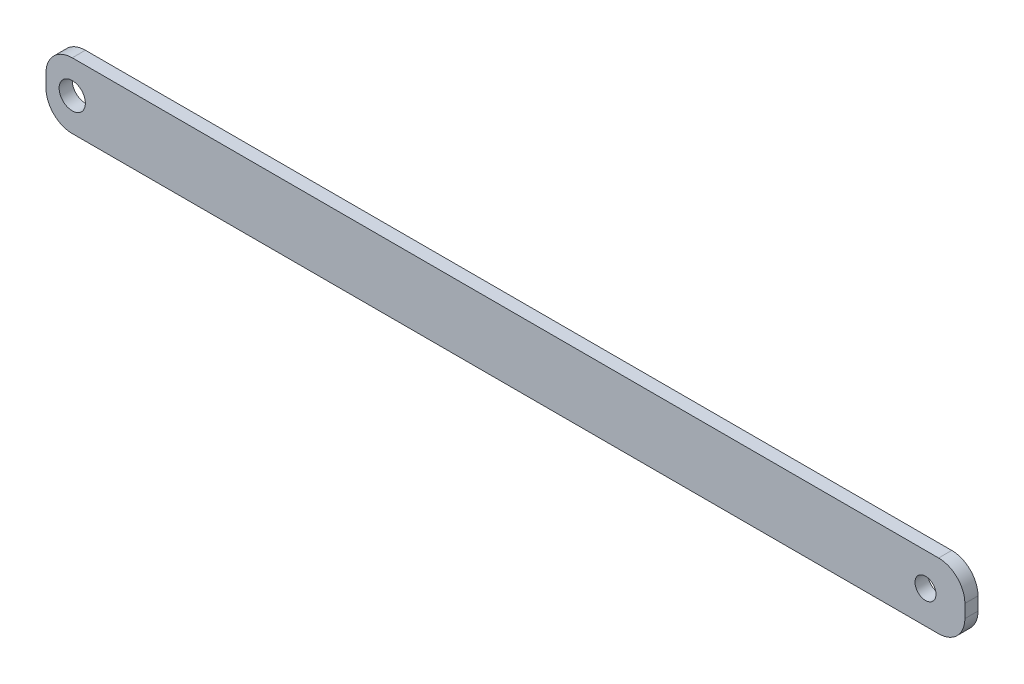
ISO-10303-21;
HEADER;
FILE_DESCRIPTION(('STEP AP214'),'2;1');
FILE_NAME('part.step','',(''),(''),'','','');
FILE_SCHEMA(('AUTOMOTIVE_DESIGN { 1 0 10303 214 1 1 1 1 }'));
ENDSEC;
DATA;
#1=APPLICATION_CONTEXT('core data for automotive mechanical design processes');
#2=APPLICATION_PROTOCOL_DEFINITION('international standard','automotive_design',2000,#1);
#3=PRODUCT_CONTEXT('',#1,'mechanical');
#4=PRODUCT('Part','Part','',(#3));
#5=PRODUCT_RELATED_PRODUCT_CATEGORY('part','',(#4));
#6=PRODUCT_DEFINITION_FORMATION('','',#4);
#7=PRODUCT_DEFINITION_CONTEXT('part definition',#1,'design');
#8=PRODUCT_DEFINITION('design','',#6,#7);
#9=PRODUCT_DEFINITION_SHAPE('','',#8);
#10=(LENGTH_UNIT() NAMED_UNIT(*) SI_UNIT(.MILLI.,.METRE.));
#11=(NAMED_UNIT(*) PLANE_ANGLE_UNIT() SI_UNIT($,.RADIAN.));
#12=(NAMED_UNIT(*) SI_UNIT($,.STERADIAN.) SOLID_ANGLE_UNIT());
#13=UNCERTAINTY_MEASURE_WITH_UNIT(LENGTH_MEASURE(1.E-05),#10,'distance_accuracy_value','');
#14=(GEOMETRIC_REPRESENTATION_CONTEXT(3) GLOBAL_UNCERTAINTY_ASSIGNED_CONTEXT((#13)) GLOBAL_UNIT_ASSIGNED_CONTEXT((#10,
#11,#12)) REPRESENTATION_CONTEXT('',''));
#15=CARTESIAN_POINT('',(0.,0.,0.));
#16=DIRECTION('',(0.,0.,1.));
#17=DIRECTION('',(1.,0.,0.));
#18=AXIS2_PLACEMENT_3D('',#15,#16,#17);
#19=CARTESIAN_POINT('',(15.,-12.5,2.5));
#20=DIRECTION('',(-1.,0.,0.));
#21=DIRECTION('',(0.,1.,0.));
#22=AXIS2_PLACEMENT_3D('',#19,#20,#21);
#23=PLANE('',#22);
#24=DIRECTION('',(0.,0.,1.));
#25=VECTOR('',#24,1.);
#26=CARTESIAN_POINT('',(15.,-2.5,2.5));
#27=LINE('',#26,#25);
#28=CARTESIAN_POINT('',(15.,-2.5,-2.5));
#29=VERTEX_POINT('',#28);
#30=CARTESIAN_POINT('',(15.,-2.5,2.5));
#31=VERTEX_POINT('',#30);
#32=EDGE_CURVE('E11',#29,#31,#27,.T.);
#33=ORIENTED_EDGE('',*,*,#32,.F.);
#34=DIRECTION('',(0.,1.,0.));
#35=VECTOR('',#34,1.);
#36=CARTESIAN_POINT('',(15.,-12.5,-2.5));
#37=LINE('',#36,#35);
#38=CARTESIAN_POINT('',(15.,2.5,-2.5));
#39=VERTEX_POINT('',#38);
#40=EDGE_CURVE('E103',#29,#39,#37,.T.);
#41=ORIENTED_EDGE('',*,*,#40,.T.);
#42=DIRECTION('',(0.,0.,1.));
#43=VECTOR('',#42,1.);
#44=CARTESIAN_POINT('',(15.,2.5,2.5));
#45=LINE('',#44,#43);
#46=CARTESIAN_POINT('',(15.,2.5,2.5));
#47=VERTEX_POINT('',#46);
#48=EDGE_CURVE('E46',#39,#47,#45,.T.);
#49=ORIENTED_EDGE('',*,*,#48,.T.);
#50=DIRECTION('',(0.,1.,0.));
#51=VECTOR('',#50,1.);
#52=CARTESIAN_POINT('',(15.,-12.5,2.5));
#53=LINE('',#52,#51);
#54=EDGE_CURVE('E145',#31,#47,#53,.T.);
#55=ORIENTED_EDGE('',*,*,#54,.F.);
#56=EDGE_LOOP('',(#33,#41,#49,#55));
#57=FACE_BOUND('',#56,.T.);
#58=ADVANCED_FACE('F36',(#57),#23,.F.);
#59=CARTESIAN_POINT('',(5.,2.5,2.5));
#60=DIRECTION('',(0.,0.,-1.));
#61=DIRECTION('',(-1.,0.,0.));
#62=AXIS2_PLACEMENT_3D('',#59,#60,#61);
#63=CYLINDRICAL_SURFACE('',#62,10.);
#64=ORIENTED_EDGE('',*,*,#48,.F.);
#65=CARTESIAN_POINT('',(5.,2.5,-2.5));
#66=DIRECTION('',(0.,0.,-1.));
#67=DIRECTION('',(-1.,0.,0.));
#68=AXIS2_PLACEMENT_3D('',#65,#66,#67);
#69=CIRCLE('',#68,10.);
#70=CARTESIAN_POINT('',(5.,12.5,-2.5));
#71=VERTEX_POINT('',#70);
#72=EDGE_CURVE('E125',#39,#71,#69,.F.);
#73=ORIENTED_EDGE('',*,*,#72,.T.);
#74=DIRECTION('',(0.,0.,1.));
#75=VECTOR('',#74,1.);
#76=CARTESIAN_POINT('',(5.,12.5,2.5));
#77=LINE('',#76,#75);
#78=CARTESIAN_POINT('',(5.,12.5,2.5));
#79=VERTEX_POINT('',#78);
#80=EDGE_CURVE('E138',#71,#79,#77,.T.);
#81=ORIENTED_EDGE('',*,*,#80,.T.);
#82=CARTESIAN_POINT('',(5.,2.5,2.5));
#83=DIRECTION('',(0.,0.,-1.));
#84=DIRECTION('',(-1.,0.,0.));
#85=AXIS2_PLACEMENT_3D('',#82,#83,#84);
#86=CIRCLE('',#85,10.);
#87=EDGE_CURVE('E154',#47,#79,#86,.F.);
#88=ORIENTED_EDGE('',*,*,#87,.F.);
#89=EDGE_LOOP('',(#64,#73,#81,#88));
#90=FACE_BOUND('',#89,.T.);
#91=ADVANCED_FACE('F157',(#90),#63,.T.);
#92=CARTESIAN_POINT('',(-335.,12.5,2.50000000000004));
#93=DIRECTION('',(0.,1.,0.));
#94=DIRECTION('',(1.,0.,0.));
#95=AXIS2_PLACEMENT_3D('',#92,#93,#94);
#96=PLANE('',#95);
#97=ORIENTED_EDGE('',*,*,#80,.F.);
#98=DIRECTION('',(-1.,0.,0.));
#99=VECTOR('',#98,1.);
#100=CARTESIAN_POINT('',(-335.,12.5,-2.49999999999996));
#101=LINE('',#100,#99);
#102=CARTESIAN_POINT('',(-325.,12.5,-2.49999999999996));
#103=VERTEX_POINT('',#102);
#104=EDGE_CURVE('E122',#103,#71,#101,.F.);
#105=ORIENTED_EDGE('',*,*,#104,.F.);
#106=DIRECTION('',(0.,0.,1.));
#107=VECTOR('',#106,1.);
#108=CARTESIAN_POINT('',(-325.,12.5,2.50000000000004));
#109=LINE('',#108,#107);
#110=CARTESIAN_POINT('',(-325.,12.5,2.50000000000004));
#111=VERTEX_POINT('',#110);
#112=EDGE_CURVE('E135',#103,#111,#109,.T.);
#113=ORIENTED_EDGE('',*,*,#112,.T.);
#114=DIRECTION('',(1.,0.,0.));
#115=VECTOR('',#114,1.);
#116=CARTESIAN_POINT('',(-335.,12.5,2.50000000000004));
#117=LINE('',#116,#115);
#118=EDGE_CURVE('E158',#111,#79,#117,.T.);
#119=ORIENTED_EDGE('',*,*,#118,.T.);
#120=EDGE_LOOP('',(#97,#105,#113,#119));
#121=FACE_BOUND('',#120,.T.);
#122=ADVANCED_FACE('F200',(#121),#96,.T.);
#123=CARTESIAN_POINT('',(-325.,2.5,2.50000000000004));
#124=DIRECTION('',(0.,0.,-1.));
#125=DIRECTION('',(-1.,0.,0.));
#126=AXIS2_PLACEMENT_3D('',#123,#124,#125);
#127=CYLINDRICAL_SURFACE('',#126,10.);
#128=ORIENTED_EDGE('',*,*,#112,.F.);
#129=CARTESIAN_POINT('',(-325.,2.5,-2.49999999999996));
#130=DIRECTION('',(0.,0.,-1.));
#131=DIRECTION('',(-1.,0.,0.));
#132=AXIS2_PLACEMENT_3D('',#129,#130,#131);
#133=CIRCLE('',#132,10.);
#134=CARTESIAN_POINT('',(-335.,2.5,-2.49999999999996));
#135=VERTEX_POINT('',#134);
#136=EDGE_CURVE('E119',#103,#135,#133,.F.);
#137=ORIENTED_EDGE('',*,*,#136,.T.);
#138=DIRECTION('',(0.,0.,1.));
#139=VECTOR('',#138,1.);
#140=CARTESIAN_POINT('',(-335.,2.5,2.50000000000004));
#141=LINE('',#140,#139);
#142=CARTESIAN_POINT('',(-335.,2.5,2.50000000000004));
#143=VERTEX_POINT('',#142);
#144=EDGE_CURVE('E132',#135,#143,#141,.T.);
#145=ORIENTED_EDGE('',*,*,#144,.T.);
#146=CARTESIAN_POINT('',(-325.,2.5,2.50000000000004));
#147=DIRECTION('',(0.,0.,-1.));
#148=DIRECTION('',(-1.,0.,0.));
#149=AXIS2_PLACEMENT_3D('',#146,#147,#148);
#150=CIRCLE('',#149,10.);
#151=EDGE_CURVE('E160',#111,#143,#150,.F.);
#152=ORIENTED_EDGE('',*,*,#151,.F.);
#153=EDGE_LOOP('',(#128,#137,#145,#152));
#154=FACE_BOUND('',#153,.T.);
#155=ADVANCED_FACE('F205',(#154),#127,.T.);
#156=CARTESIAN_POINT('',(-335.,-12.5,2.50000000000004));
#157=DIRECTION('',(-1.,0.,0.));
#158=DIRECTION('',(0.,1.,0.));
#159=AXIS2_PLACEMENT_3D('',#156,#157,#158);
#160=PLANE('',#159);
#161=ORIENTED_EDGE('',*,*,#144,.F.);
#162=DIRECTION('',(0.,1.,0.));
#163=VECTOR('',#162,1.);
#164=CARTESIAN_POINT('',(-335.,-12.5,-2.49999999999996));
#165=LINE('',#164,#163);
#166=CARTESIAN_POINT('',(-335.,-2.5,-2.49999999999996));
#167=VERTEX_POINT('',#166);
#168=EDGE_CURVE('E116',#167,#135,#165,.T.);
#169=ORIENTED_EDGE('',*,*,#168,.F.);
#170=DIRECTION('',(0.,0.,1.));
#171=VECTOR('',#170,1.);
#172=CARTESIAN_POINT('',(-335.,-2.5,2.50000000000004));
#173=LINE('',#172,#171);
#174=CARTESIAN_POINT('',(-335.,-2.5,2.50000000000004));
#175=VERTEX_POINT('',#174);
#176=EDGE_CURVE('E130',#167,#175,#173,.T.);
#177=ORIENTED_EDGE('',*,*,#176,.T.);
#178=DIRECTION('',(0.,1.,0.));
#179=VECTOR('',#178,1.);
#180=CARTESIAN_POINT('',(-335.,-12.5,2.50000000000004));
#181=LINE('',#180,#179);
#182=EDGE_CURVE('E166',#175,#143,#181,.T.);
#183=ORIENTED_EDGE('',*,*,#182,.T.);
#184=EDGE_LOOP('',(#161,#169,#177,#183));
#185=FACE_BOUND('',#184,.T.);
#186=ADVANCED_FACE('F209',(#185),#160,.T.);
#187=CARTESIAN_POINT('',(-325.,-2.5,2.50000000000004));
#188=DIRECTION('',(0.,0.,-1.));
#189=DIRECTION('',(-1.,0.,0.));
#190=AXIS2_PLACEMENT_3D('',#187,#188,#189);
#191=CYLINDRICAL_SURFACE('',#190,10.);
#192=ORIENTED_EDGE('',*,*,#176,.F.);
#193=CARTESIAN_POINT('',(-325.,-2.5,-2.49999999999996));
#194=DIRECTION('',(0.,0.,-1.));
#195=DIRECTION('',(-1.,0.,0.));
#196=AXIS2_PLACEMENT_3D('',#193,#194,#195);
#197=CIRCLE('',#196,10.);
#198=CARTESIAN_POINT('',(-325.,-12.5,-2.49999999999996));
#199=VERTEX_POINT('',#198);
#200=EDGE_CURVE('E113',#167,#199,#197,.F.);
#201=ORIENTED_EDGE('',*,*,#200,.T.);
#202=DIRECTION('',(0.,0.,1.));
#203=VECTOR('',#202,1.);
#204=CARTESIAN_POINT('',(-325.,-12.5,2.50000000000004));
#205=LINE('',#204,#203);
#206=CARTESIAN_POINT('',(-325.,-12.5,2.50000000000004));
#207=VERTEX_POINT('',#206);
#208=EDGE_CURVE('E54',#199,#207,#205,.T.);
#209=ORIENTED_EDGE('',*,*,#208,.T.);
#210=CARTESIAN_POINT('',(-325.,-2.5,2.50000000000004));
#211=DIRECTION('',(0.,0.,-1.));
#212=DIRECTION('',(-1.,0.,0.));
#213=AXIS2_PLACEMENT_3D('',#210,#211,#212);
#214=CIRCLE('',#213,10.);
#215=EDGE_CURVE('E96',#175,#207,#214,.F.);
#216=ORIENTED_EDGE('',*,*,#215,.F.);
#217=EDGE_LOOP('',(#192,#201,#209,#216));
#218=FACE_BOUND('',#217,.T.);
#219=ADVANCED_FACE('F213',(#218),#191,.T.);
#220=CARTESIAN_POINT('',(-335.,-12.5,2.50000000000004));
#221=DIRECTION('',(0.,1.,0.));
#222=DIRECTION('',(1.,0.,0.));
#223=AXIS2_PLACEMENT_3D('',#220,#221,#222);
#224=PLANE('',#223);
#225=ORIENTED_EDGE('',*,*,#208,.F.);
#226=DIRECTION('',(-1.,0.,0.));
#227=VECTOR('',#226,1.);
#228=CARTESIAN_POINT('',(-335.,-12.5,-2.49999999999996));
#229=LINE('',#228,#227);
#230=CARTESIAN_POINT('',(5.,-12.5,-2.5));
#231=VERTEX_POINT('',#230);
#232=EDGE_CURVE('E101',#199,#231,#229,.F.);
#233=ORIENTED_EDGE('',*,*,#232,.T.);
#234=DIRECTION('',(0.,0.,1.));
#235=VECTOR('',#234,1.);
#236=CARTESIAN_POINT('',(5.,-12.5,2.5));
#237=LINE('',#236,#235);
#238=CARTESIAN_POINT('',(5.,-12.5,2.5));
#239=VERTEX_POINT('',#238);
#240=EDGE_CURVE('E40',#231,#239,#237,.T.);
#241=ORIENTED_EDGE('',*,*,#240,.T.);
#242=DIRECTION('',(1.,0.,0.));
#243=VECTOR('',#242,1.);
#244=CARTESIAN_POINT('',(-335.,-12.5,2.50000000000004));
#245=LINE('',#244,#243);
#246=EDGE_CURVE('E343',#207,#239,#245,.T.);
#247=ORIENTED_EDGE('',*,*,#246,.F.);
#248=EDGE_LOOP('',(#225,#233,#241,#247));
#249=FACE_BOUND('',#248,.T.);
#250=ADVANCED_FACE('F105',(#249),#224,.F.);
#251=CARTESIAN_POINT('',(-325.,0.,2.50000000000004));
#252=DIRECTION('',(0.,0.,-1.));
#253=DIRECTION('',(-1.,0.,0.));
#254=AXIS2_PLACEMENT_3D('',#251,#252,#253);
#255=CYLINDRICAL_SURFACE('',#254,4.99999999999999);
#256=CARTESIAN_POINT('',(-325.,0.,2.50000000000004));
#257=DIRECTION('',(0.,0.,-1.));
#258=DIRECTION('',(-1.,0.,0.));
#259=AXIS2_PLACEMENT_3D('',#256,#257,#258);
#260=CIRCLE('',#259,4.99999999999999);
#261=CARTESIAN_POINT('',(-330.,0.,2.50000000000004));
#262=VERTEX_POINT('',#261);
#263=EDGE_CURVE('E115',#262,#262,#260,.T.);
#264=ORIENTED_EDGE('',*,*,#263,.F.);
#265=EDGE_LOOP('',(#264));
#266=FACE_BOUND('',#265,.T.);
#267=CARTESIAN_POINT('',(-325.,0.,-2.49999999999996));
#268=DIRECTION('',(0.,0.,-1.));
#269=DIRECTION('',(-1.,0.,0.));
#270=AXIS2_PLACEMENT_3D('',#267,#268,#269);
#271=CIRCLE('',#270,4.99999999999999);
#272=CARTESIAN_POINT('',(-330.,0.,-2.49999999999996));
#273=VERTEX_POINT('',#272);
#274=EDGE_CURVE('E109',#273,#273,#271,.T.);
#275=ORIENTED_EDGE('',*,*,#274,.T.);
#276=EDGE_LOOP('',(#275));
#277=FACE_BOUND('',#276,.T.);
#278=ADVANCED_FACE('F173',(#266,#277),#255,.F.);
#279=CARTESIAN_POINT('',(0.,0.,2.5));
#280=DIRECTION('',(0.,0.,-1.));
#281=DIRECTION('',(-1.,0.,0.));
#282=AXIS2_PLACEMENT_3D('',#279,#280,#281);
#283=CYLINDRICAL_SURFACE('',#282,4.);
#284=CARTESIAN_POINT('',(0.,0.,2.5));
#285=DIRECTION('',(0.,0.,1.));
#286=DIRECTION('',(1.,0.,0.));
#287=AXIS2_PLACEMENT_3D('',#284,#285,#286);
#288=CIRCLE('',#287,4.);
#289=CARTESIAN_POINT('',(4.,0.,2.5));
#290=VERTEX_POINT('',#289);
#291=EDGE_CURVE('E342',#290,#290,#288,.T.);
#292=ORIENTED_EDGE('',*,*,#291,.T.);
#293=EDGE_LOOP('',(#292));
#294=FACE_BOUND('',#293,.T.);
#295=CARTESIAN_POINT('',(0.,0.,-2.5));
#296=DIRECTION('',(0.,0.,1.));
#297=DIRECTION('',(1.,0.,0.));
#298=AXIS2_PLACEMENT_3D('',#295,#296,#297);
#299=CIRCLE('',#298,4.);
#300=CARTESIAN_POINT('',(4.,0.,-2.5));
#301=VERTEX_POINT('',#300);
#302=EDGE_CURVE('E106',#301,#301,#299,.T.);
#303=ORIENTED_EDGE('',*,*,#302,.F.);
#304=EDGE_LOOP('',(#303));
#305=FACE_BOUND('',#304,.T.);
#306=ADVANCED_FACE('F180',(#294,#305),#283,.F.);
#307=CARTESIAN_POINT('',(5.,-2.5,2.5));
#308=DIRECTION('',(0.,0.,-1.));
#309=DIRECTION('',(-1.,0.,0.));
#310=AXIS2_PLACEMENT_3D('',#307,#308,#309);
#311=CYLINDRICAL_SURFACE('',#310,10.);
#312=CARTESIAN_POINT('',(5.,-2.5,-2.5));
#313=DIRECTION('',(0.,0.,-1.));
#314=DIRECTION('',(-1.,0.,0.));
#315=AXIS2_PLACEMENT_3D('',#312,#313,#314);
#316=CIRCLE('',#315,10.);
#317=EDGE_CURVE('E90',#231,#29,#316,.F.);
#318=ORIENTED_EDGE('',*,*,#317,.T.);
#319=ORIENTED_EDGE('',*,*,#32,.T.);
#320=CARTESIAN_POINT('',(5.,-2.5,2.5));
#321=DIRECTION('',(0.,0.,-1.));
#322=DIRECTION('',(-1.,0.,0.));
#323=AXIS2_PLACEMENT_3D('',#320,#321,#322);
#324=CIRCLE('',#323,10.);
#325=EDGE_CURVE('E92',#239,#31,#324,.F.);
#326=ORIENTED_EDGE('',*,*,#325,.F.);
#327=ORIENTED_EDGE('',*,*,#240,.F.);
#328=EDGE_LOOP('',(#318,#319,#326,#327));
#329=FACE_BOUND('',#328,.T.);
#330=ADVANCED_FACE('F38',(#329),#311,.T.);
#331=CARTESIAN_POINT('',(-335.,-12.5,2.50000000000004));
#332=DIRECTION('',(0.,0.,-1.));
#333=DIRECTION('',(-1.,0.,0.));
#334=AXIS2_PLACEMENT_3D('',#331,#332,#333);
#335=PLANE('',#334);
#336=ORIENTED_EDGE('',*,*,#263,.T.);
#337=EDGE_LOOP('',(#336));
#338=FACE_BOUND('',#337,.T.);
#339=ORIENTED_EDGE('',*,*,#291,.F.);
#340=EDGE_LOOP('',(#339));
#341=FACE_BOUND('',#340,.T.);
#342=ORIENTED_EDGE('',*,*,#246,.T.);
#343=ORIENTED_EDGE('',*,*,#325,.T.);
#344=ORIENTED_EDGE('',*,*,#54,.T.);
#345=ORIENTED_EDGE('',*,*,#87,.T.);
#346=ORIENTED_EDGE('',*,*,#118,.F.);
#347=ORIENTED_EDGE('',*,*,#151,.T.);
#348=ORIENTED_EDGE('',*,*,#182,.F.);
#349=ORIENTED_EDGE('',*,*,#215,.T.);
#350=EDGE_LOOP('',(#342,#343,#344,#345,#346,#347,#348,#349));
#351=FACE_BOUND('',#350,.T.);
#352=ADVANCED_FACE('F152',(#338,#341,#351),#335,.F.);
#353=CARTESIAN_POINT('',(-335.,-12.5,-2.49999999999996));
#354=DIRECTION('',(0.,0.,-1.));
#355=DIRECTION('',(-1.,0.,0.));
#356=AXIS2_PLACEMENT_3D('',#353,#354,#355);
#357=PLANE('',#356);
#358=ORIENTED_EDGE('',*,*,#274,.F.);
#359=EDGE_LOOP('',(#358));
#360=FACE_BOUND('',#359,.T.);
#361=ORIENTED_EDGE('',*,*,#302,.T.);
#362=EDGE_LOOP('',(#361));
#363=FACE_BOUND('',#362,.T.);
#364=ORIENTED_EDGE('',*,*,#232,.F.);
#365=ORIENTED_EDGE('',*,*,#200,.F.);
#366=ORIENTED_EDGE('',*,*,#168,.T.);
#367=ORIENTED_EDGE('',*,*,#136,.F.);
#368=ORIENTED_EDGE('',*,*,#104,.T.);
#369=ORIENTED_EDGE('',*,*,#72,.F.);
#370=ORIENTED_EDGE('',*,*,#40,.F.);
#371=ORIENTED_EDGE('',*,*,#317,.F.);
#372=EDGE_LOOP('',(#364,#365,#366,#367,#368,#369,#370,#371));
#373=FACE_BOUND('',#372,.T.);
#374=ADVANCED_FACE('F99',(#360,#363,#373),#357,.T.);
#375=CLOSED_SHELL('',(#58,#91,#122,#155,#186,#219,#250,#278,#306,#330,#352,#374));
#376=MANIFOLD_SOLID_BREP('B2',#375);
#377=ADVANCED_BREP_SHAPE_REPRESENTATION('',(#18,#376),#14);
#378=SHAPE_DEFINITION_REPRESENTATION(#9,#377);
ENDSEC;
END-ISO-10303-21;
